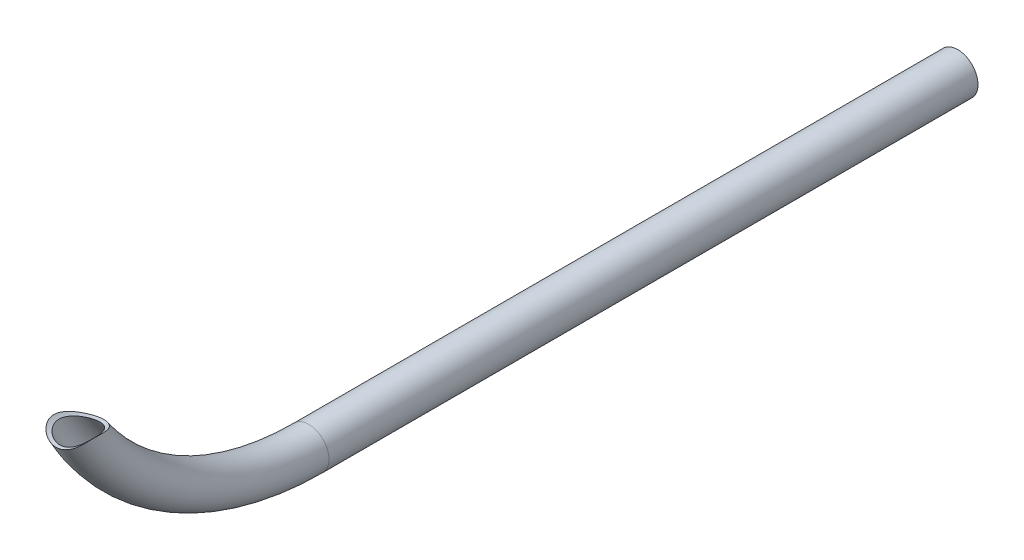
ISO-10303-21;
HEADER;
FILE_DESCRIPTION(('STEP AP214'),'2;1');
FILE_NAME('part.step','',(''),(''),'','','');
FILE_SCHEMA(('AUTOMOTIVE_DESIGN { 1 0 10303 214 1 1 1 1 }'));
ENDSEC;
DATA;
#1=APPLICATION_CONTEXT('core data for automotive mechanical design processes');
#2=APPLICATION_PROTOCOL_DEFINITION('international standard','automotive_design',2000,#1);
#3=PRODUCT_CONTEXT('',#1,'mechanical');
#4=PRODUCT('Part','Part','',(#3));
#5=PRODUCT_RELATED_PRODUCT_CATEGORY('part','',(#4));
#6=PRODUCT_DEFINITION_FORMATION('','',#4);
#7=PRODUCT_DEFINITION_CONTEXT('part definition',#1,'design');
#8=PRODUCT_DEFINITION('design','',#6,#7);
#9=PRODUCT_DEFINITION_SHAPE('','',#8);
#10=(LENGTH_UNIT() NAMED_UNIT(*) SI_UNIT(.MILLI.,.METRE.));
#11=(NAMED_UNIT(*) PLANE_ANGLE_UNIT() SI_UNIT($,.RADIAN.));
#12=(NAMED_UNIT(*) SI_UNIT($,.STERADIAN.) SOLID_ANGLE_UNIT());
#13=UNCERTAINTY_MEASURE_WITH_UNIT(LENGTH_MEASURE(1.E-05),#10,'distance_accuracy_value','');
#14=(GEOMETRIC_REPRESENTATION_CONTEXT(3) GLOBAL_UNCERTAINTY_ASSIGNED_CONTEXT((#13)) GLOBAL_UNIT_ASSIGNED_CONTEXT((#10,
#11,#12)) REPRESENTATION_CONTEXT('',''));
#15=CARTESIAN_POINT('',(0.,0.,0.));
#16=DIRECTION('',(0.,0.,1.));
#17=DIRECTION('',(1.,0.,0.));
#18=AXIS2_PLACEMENT_3D('',#15,#16,#17);
#19=CARTESIAN_POINT('',(0.,127.,304.800000000001));
#20=DIRECTION('',(-1.,0.,0.));
#21=DIRECTION('',(0.,0.,1.));
#22=AXIS2_PLACEMENT_3D('',#19,#20,#21);
#23=TOROIDAL_SURFACE('',#22,127.,9.525);
#24=CARTESIAN_POINT('',(0.,0.,304.800000000001));
#25=DIRECTION('',(0.,0.,1.));
#26=DIRECTION('',(1.,0.,0.));
#27=AXIS2_PLACEMENT_3D('',#24,#25,#26);
#28=CIRCLE('',#27,9.525);
#29=CARTESIAN_POINT('',(9.52500000000003,0.,304.800000000001));
#30=VERTEX_POINT('',#29);
#31=EDGE_CURVE('E12',#30,#30,#28,.T.);
#32=ORIENTED_EDGE('',*,*,#31,.T.);
#33=EDGE_LOOP('',(#32));
#34=FACE_BOUND('',#33,.T.);
#35=CARTESIAN_POINT('',(-3.65407289127607,60.0682852372543,402.228333893219));
#36=CARTESIAN_POINT('',(-3.39446582058791,59.9902898235014,402.043905005241));
#37=CARTESIAN_POINT('',(-3.12314992074199,59.9178171309632,401.873248482189));
#38=CARTESIAN_POINT('',(-2.55688897704432,59.7879230241038,401.568113537314));
#39=CARTESIAN_POINT('',(-2.26194025002623,59.730503961865,401.433640769002));
#40=CARTESIAN_POINT('',(-1.80286286501734,59.6588939704098,401.266174522086));
#41=CARTESIAN_POINT('',(-1.64608747824195,59.6373606851069,401.215866525132));
#42=CARTESIAN_POINT('',(-1.32829403480961,59.599892940194,401.128380667154));
#43=CARTESIAN_POINT('',(-1.16727821118621,59.5839555946979,401.09119603822));
#44=CARTESIAN_POINT('',(-0.842306863073849,59.5581658959882,401.031044427609));
#45=CARTESIAN_POINT('',(-0.678354839754438,59.5483067352475,401.008061540008));
#46=CARTESIAN_POINT('',(-0.34878644448164,59.5349698568978,400.976975266853));
#47=CARTESIAN_POINT('',(-0.183170255597932,59.5314914449251,400.968870262262));
#48=CARTESIAN_POINT('',(0.132234627307229,59.5310547334472,400.967852666404));
#49=CARTESIAN_POINT('',(0.282020053585471,59.533503886882,400.973559390485));
#50=CARTESIAN_POINT('',(0.580429881178755,59.5436424596715,400.997189237646));
#51=CARTESIAN_POINT('',(0.729054377924088,59.5513314436194,401.015111345681));
#52=CARTESIAN_POINT('',(1.02412588722164,59.5717455367284,401.062714703607));
#53=CARTESIAN_POINT('',(1.17057169103837,59.5844733406869,401.092402245746));
#54=CARTESIAN_POINT('',(1.46034040699285,59.6146479947505,401.162827465699));
#55=CARTESIAN_POINT('',(1.60366167684346,59.6320972648262,401.203570810155));
#56=CARTESIAN_POINT('',(1.92094768445456,59.6761120437016,401.306424795505));
#57=CARTESIAN_POINT('',(2.09384584439978,59.7038632188295,401.371323765817));
#58=CARTESIAN_POINT('',(2.43275197137232,59.7652394077167,401.515045262456));
#59=CARTESIAN_POINT('',(2.5987549049072,59.798868622298,401.593877747015));
#60=CARTESIAN_POINT('',(2.92350680753485,59.8712005639203,401.763709663485));
#61=CARTESIAN_POINT('',(3.0822460808694,59.9099098200009,401.854724755944));
#62=CARTESIAN_POINT('',(3.39205977312419,59.9915770960582,402.047119926029));
#63=CARTESIAN_POINT('',(3.54313590121663,60.0345341622517,402.148497677043));
#64=CARTESIAN_POINT('',(3.92298149826358,60.1498885148328,402.421362000143));
#65=CARTESIAN_POINT('',(4.14617847259037,60.2249494933534,402.599499324163));
#66=CARTESIAN_POINT('',(4.5749292539373,60.3816858171912,402.973245767583));
#67=CARTESIAN_POINT('',(4.78047219526507,60.4633651767358,403.168865498052));
#68=CARTESIAN_POINT('',(5.17559889954713,60.6317077394009,403.574457227334));
#69=CARTESIAN_POINT('',(5.36514558064082,60.7183817790632,403.784460634644));
#70=CARTESIAN_POINT('',(5.72914516537296,60.8951201496679,404.215884272408));
#71=CARTESIAN_POINT('',(5.90359257990585,60.9851856966074,404.437308608468));
#72=CARTESIAN_POINT('',(6.21801370632419,61.1563105140321,404.861918729685));
#73=CARTESIAN_POINT('',(6.35959393981204,61.2371235571711,405.06402164135));
#74=CARTESIAN_POINT('',(6.63268481873626,61.3996876183345,405.474558487916));
#75=CARTESIAN_POINT('',(6.7641948994001,61.4814386886719,405.682992776989));
#76=CARTESIAN_POINT('',(7.01780370985594,61.6452577328224,406.105612653312));
#77=CARTESIAN_POINT('',(7.13989524338635,61.7273258996139,406.319802472875));
#78=CARTESIAN_POINT('',(7.37502226881112,61.8910581533166,406.753255300646));
#79=CARTESIAN_POINT('',(7.48805728053802,61.9727222185876,406.97251857705));
#80=CARTESIAN_POINT('',(7.70546114071106,62.1349995221391,407.415822576774));
#81=CARTESIAN_POINT('',(7.80982576197272,62.21561223188,407.639865564284));
#82=CARTESIAN_POINT('',(8.01005245550382,62.3750118328613,408.092341601807));
#83=CARTESIAN_POINT('',(8.10591492004587,62.4537988082134,408.320774448688));
#84=CARTESIAN_POINT('',(8.28919635238499,62.6086927800759,408.781721672569));
#85=CARTESIAN_POINT('',(8.37662045434234,62.684801388045,409.014233464727));
#86=CARTESIAN_POINT('',(8.54306676272146,62.8334597916069,409.483365087313));
#87=CARTESIAN_POINT('',(8.62208902098279,62.9060096091562,409.719984892384));
#88=CARTESIAN_POINT('',(8.78708863321079,63.061058973088,410.24684396073));
#89=CARTESIAN_POINT('',(8.87110384885645,63.1424970880538,410.538016263692));
#90=CARTESIAN_POINT('',(9.02598645628956,63.2962918993281,411.126161344371));
#91=CARTESIAN_POINT('',(9.09685671626038,63.368650575621,411.423132841056));
#92=CARTESIAN_POINT('',(9.22424768494676,63.5013188065028,412.022282227));
#93=CARTESIAN_POINT('',(9.28079295314293,63.5616489450602,412.324450243875));
#94=CARTESIAN_POINT('',(9.37798594078855,63.6668738515069,412.934008099964));
#95=CARTESIAN_POINT('',(9.41863906569889,63.7117738670788,413.241396126491));
#96=CARTESIAN_POINT('',(9.4726256129091,63.7719067443289,413.771634638727));
#97=CARTESIAN_POINT('',(9.49044898488311,63.7919535113525,413.993479602908));
#98=CARTESIAN_POINT('',(9.51567820358175,63.8204091216456,414.438480900445));
#99=CARTESIAN_POINT('',(9.5230876317505,63.8288219659043,414.661636756449));
#100=CARTESIAN_POINT('',(9.52626243575553,63.8324202843576,415.107853017769));
#101=CARTESIAN_POINT('',(9.52204521582021,63.8276255293562,415.330913066389));
#102=CARTESIAN_POINT('',(9.50072780294525,63.8035314854817,415.77567070928));
#103=CARTESIAN_POINT('',(9.48362820925898,63.7842328712892,415.997368366442));
#104=CARTESIAN_POINT('',(9.43509153084246,63.7300505942675,416.440047974746));
#105=CARTESIAN_POINT('',(9.40348443970569,63.6949822350674,416.660989231201));
#106=CARTESIAN_POINT('',(9.32498652283707,63.6093017910756,417.097086048305));
#107=CARTESIAN_POINT('',(9.27809592549277,63.5586899385573,417.312241695358));
#108=CARTESIAN_POINT('',(9.16857348448465,63.4429856918737,417.734593476993));
#109=CARTESIAN_POINT('',(9.10593536834032,63.3778875287762,417.941786401897));
#110=CARTESIAN_POINT('',(8.96497301705563,63.2351791415148,418.346269034637));
#111=CARTESIAN_POINT('',(8.88664905937227,63.1575691386697,418.543558917566));
#112=CARTESIAN_POINT('',(8.72754541325557,63.0046448194266,418.898469315657));
#113=CARTESIAN_POINT('',(8.64885744588802,62.9307009279983,419.05763017448));
#114=CARTESIAN_POINT('',(8.48082489111687,62.7772267485083,419.367478629065));
#115=CARTESIAN_POINT('',(8.39147643689172,62.6976944377154,419.518163120897));
#116=CARTESIAN_POINT('',(8.20262218081754,62.5347277916357,419.810800081772));
#117=CARTESIAN_POINT('',(8.10311550893213,62.4512931224498,419.952751801193));
#118=CARTESIAN_POINT('',(7.89444351406386,62.2820886684786,420.227903548822));
#119=CARTESIAN_POINT('',(7.78527690679335,62.1963185742512,420.361102409223));
#120=CARTESIAN_POINT('',(7.54009124227722,62.0104765584426,420.638861555991));
#121=CARTESIAN_POINT('',(7.40253642251584,61.9102548499805,420.781967264375));
#122=CARTESIAN_POINT('',(7.11594745189997,61.7106131124383,421.056777709409));
#123=CARTESIAN_POINT('',(6.96691255829329,61.6111931356903,421.188481707205));
#124=CARTESIAN_POINT('',(6.65801850410045,61.4148600140516,421.440750543951));
#125=CARTESIAN_POINT('',(6.49815462389535,61.3179479879686,421.561310471125));
#126=CARTESIAN_POINT('',(6.16837482057322,61.1282164442304,421.791400631668));
#127=CARTESIAN_POINT('',(5.99845827492002,61.0353971806523,421.900930180816));
#128=CARTESIAN_POINT('',(5.61731612339234,60.8387192994099,422.128140260298));
#129=CARTESIAN_POINT('',(5.40422266862402,60.7359504128175,422.243642284326));
#130=CARTESIAN_POINT('',(4.96622251868712,60.5400477677898,422.459466153995));
#131=CARTESIAN_POINT('',(4.74131456921058,60.4469150355246,422.559786383425));
#132=CARTESIAN_POINT('',(4.28099319486151,60.2719971435257,422.745248897871));
#133=CARTESIAN_POINT('',(4.04557739880043,60.1902145623386,422.830387735198));
#134=CARTESIAN_POINT('',(3.56576676957602,60.0395092873635,422.985370728169));
#135=CARTESIAN_POINT('',(3.32137210048271,59.9705863587321,423.055215163123));
#136=CARTESIAN_POINT('',(2.81902477765969,59.8452999558493,423.181029266192));
#137=CARTESIAN_POINT('',(2.56088612483817,59.7892911724653,423.236610986578));
#138=CARTESIAN_POINT('',(2.03870581233758,59.6931416936871,423.331428088934));
#139=CARTESIAN_POINT('',(1.77466399030895,59.6530014352792,423.370663020748));
#140=CARTESIAN_POINT('',(1.2427174011836,59.5893595971334,423.432648535548));
#141=CARTESIAN_POINT('',(0.97481339551633,59.5658547822807,423.455402323661));
#142=CARTESIAN_POINT('',(0.437167863702882,59.5359214716572,423.48435178717));
#143=CARTESIAN_POINT('',(0.167426407103095,59.5294923331435,423.490548085804));
#144=CARTESIAN_POINT('',(-0.36146588442569,59.5337467678595,423.486440885314));
#145=CARTESIAN_POINT('',(-0.620627187403028,59.5437852280946,423.476759397387));
#146=CARTESIAN_POINT('',(-1.13682518773813,59.5795876924395,423.442096740522));
#147=CARTESIAN_POINT('',(-1.39386194048517,59.6053512852593,423.417115971736));
#148=CARTESIAN_POINT('',(-1.90396139542837,59.6721460098193,423.351943136385));
#149=CARTESIAN_POINT('',(-2.15702448639812,59.7131756381442,423.311752567691));
#150=CARTESIAN_POINT('',(-2.65746000353367,59.8097826841055,423.21627972999));
#151=CARTESIAN_POINT('',(-2.90483236871844,59.8653602575567,423.160997299342));
#152=CARTESIAN_POINT('',(-3.39203146376182,59.9900369889648,423.03552936901));
#153=CARTESIAN_POINT('',(-3.63186457327754,60.0591243368839,422.965356881456));
#154=CARTESIAN_POINT('',(-4.10269555703875,60.2096454920464,422.810200190935));
#155=CARTESIAN_POINT('',(-4.3336934281312,60.2910793036959,422.725215982681));
#156=CARTESIAN_POINT('',(-4.78560133967106,60.4649139320031,422.540455163501));
#157=CARTESIAN_POINT('',(-5.00650506015247,60.5573214925109,422.440669446919));
#158=CARTESIAN_POINT('',(-5.43678915326098,60.7513968299268,422.226348496822));
#159=CARTESIAN_POINT('',(-5.6461693141017,60.8530647769363,422.111812992356));
#160=CARTESIAN_POINT('',(-6.06035731435301,61.0679774720857,421.863004013094));
#161=CARTESIAN_POINT('',(-6.26464476785758,61.181523022984,421.728123046904));
#162=CARTESIAN_POINT('',(-6.6581868986955,61.4140974163791,421.442060106849));
#163=CARTESIAN_POINT('',(-6.84743984437133,61.5331268880202,421.29087625995));
#164=CARTESIAN_POINT('',(-7.20950762935861,61.7737065486939,420.971974147088));
#165=CARTESIAN_POINT('',(-7.38233166453008,61.8952552806385,420.80426523915));
#166=CARTESIAN_POINT('',(-7.7103183755973,62.1375625195798,420.451887839535));
#167=CARTESIAN_POINT('',(-7.86548628912784,62.2583212508563,420.26722440689));
#168=CARTESIAN_POINT('',(-8.12282673326841,62.4675189893796,419.925799115829));
#169=CARTESIAN_POINT('',(-8.22891888710564,62.5569271801467,419.772574587989));
#170=CARTESIAN_POINT('',(-8.42930440741372,62.7310168489821,419.456073514601));
#171=CARTESIAN_POINT('',(-8.5236006176663,62.8156994635611,419.292799406036));
#172=CARTESIAN_POINT('',(-8.69967527157459,62.9781431759824,418.956745801445));
#173=CARTESIAN_POINT('',(-8.78147457954073,63.0559157176882,418.783982818213));
#174=CARTESIAN_POINT('',(-8.93226090460856,63.2026403358156,418.429332616981));
#175=CARTESIAN_POINT('',(-9.00124799898925,63.2715924654381,418.247445454024));
#176=CARTESIAN_POINT('',(-9.1264652303261,63.3991674988767,417.874557954176));
#177=CARTESIAN_POINT('',(-9.18262203067246,63.4577306147717,417.683512426583));
#178=CARTESIAN_POINT('',(-9.28167612057952,63.5625879324055,417.294742141975));
#179=CARTESIAN_POINT('',(-9.32457396775987,63.6088826500935,417.097017666239));
#180=CARTESIAN_POINT('',(-9.39747556660737,63.6883949149186,416.696533092845));
#181=CARTESIAN_POINT('',(-9.4274729859219,63.7216060391238,416.493770573728));
#182=CARTESIAN_POINT('',(-9.47522062796903,63.774805013772,416.085104358627));
#183=CARTESIAN_POINT('',(-9.49296921740743,63.7947911007357,415.879200247474));
#184=CARTESIAN_POINT('',(-9.5198121875461,63.8250792871104,415.419889326343));
#185=CARTESIAN_POINT('',(-9.52610039081252,63.8322350745863,415.166111906411));
#186=CARTESIAN_POINT('',(-9.52358482214345,63.8293871723276,414.658757640843));
#187=CARTESIAN_POINT('',(-9.51477643267342,63.8193782324857,414.405180880316));
#188=CARTESIAN_POINT('',(-9.48384322647918,63.7845200762154,413.899407557627));
#189=CARTESIAN_POINT('',(-9.46169094568249,63.7596402537178,413.647214927469));
#190=CARTESIAN_POINT('',(-9.40560545984943,63.6974157256808,413.145638123203));
#191=CARTESIAN_POINT('',(-9.37166713856744,63.660065607137,412.896255217397));
#192=CARTESIAN_POINT('',(-9.29734640983724,63.5795435018926,412.426720064066));
#193=CARTESIAN_POINT('',(-9.25800137390714,63.5373810787466,412.206225337492));
#194=CARTESIAN_POINT('',(-9.17156282038169,63.446241279529,411.768244224788));
#195=CARTESIAN_POINT('',(-9.12447075344481,63.3972651796066,411.550757283687));
#196=CARTESIAN_POINT('',(-9.02301177319968,63.2936598213687,411.118662170746));
#197=CARTESIAN_POINT('',(-8.9686389021417,63.2390259417815,410.904056516543));
#198=CARTESIAN_POINT('',(-8.85300976589887,63.1251636741635,410.47793084496));
#199=CARTESIAN_POINT('',(-8.79175270011614,63.0659347520004,410.266411189705));
#200=CARTESIAN_POINT('',(-8.59741864530453,62.8821186420055,409.634468776134));
#201=CARTESIAN_POINT('',(-8.45427079730204,62.7519169995944,409.218736461485));
#202=CARTESIAN_POINT('',(-8.1420822730203,62.4824508818424,408.400397568936));
#203=CARTESIAN_POINT('',(-7.97305234311982,62.3431901816107,407.997785627148));
#204=CARTESIAN_POINT('',(-7.6899322391332,62.1232711233112,407.383398739019));
#205=CARTESIAN_POINT('',(-7.58505317795123,62.0442399642502,407.16675720242));
#206=CARTESIAN_POINT('',(-7.36689057679543,61.8853747549063,406.738025379057));
#207=CARTESIAN_POINT('',(-7.25360684364731,61.8055406862056,406.525935197047));
#208=CARTESIAN_POINT('',(-7.01817903622669,61.6456259952263,406.106530334896));
#209=CARTESIAN_POINT('',(-6.89602678826792,61.5655452123446,405.89922029827));
#210=CARTESIAN_POINT('',(-6.6424989909186,61.4058329060845,405.490144724774));
#211=CARTESIAN_POINT('',(-6.5111239922481,61.3262013561872,405.288378857843));
#212=CARTESIAN_POINT('',(-6.23976556523533,61.1687130388342,404.892846455157));
#213=CARTESIAN_POINT('',(-6.09986708389426,61.0908468541662,404.699025551629));
#214=CARTESIAN_POINT('',(-5.80977184589791,60.9368475847093,404.318461890857));
#215=CARTESIAN_POINT('',(-5.65957382006612,60.860714715056,404.131720010355));
#216=CARTESIAN_POINT('',(-5.34845105032629,60.7111018406494,403.7669275379));
#217=CARTESIAN_POINT('',(-5.18754752283192,60.637617008975,403.588860899524));
#218=CARTESIAN_POINT('',(-4.85400397706453,60.4940612420678,403.242693687061));
#219=CARTESIAN_POINT('',(-4.68136886677605,60.423988900004,403.074588999761));
#220=CARTESIAN_POINT('',(-4.36840076234326,60.3053279995282,402.791044195854));
#221=CARTESIAN_POINT('',(-4.23082794158079,60.2557595792302,402.672971263197));
#222=CARTESIAN_POINT('',(-3.94815187924166,60.1596140001923,402.444525835049));
#223=CARTESIAN_POINT('',(-3.80304005002391,60.1130403941587,402.334162472387));
#224=CARTESIAN_POINT('',(-3.65407289127607,60.0682852372543,402.228333893219));
#225=B_SPLINE_CURVE_WITH_KNOTS('',3,(#35,#36,#37,#38,#39,#40,#41,#42,#43,#44,#45,#46,#47,#48,
#49,#50,#51,#52,#53,#54,#55,#56,#57,#58,#59,#60,#61,#62,#63,#64,#65,#66,#67,#68,#69,#70,#71,#72,
#73,#74,#75,#76,#77,#78,#79,#80,#81,#82,#83,#84,#85,#86,#87,#88,#89,#90,#91,#92,#93,#94,#95,#96,
#97,#98,#99,#100,#101,#102,#103,#104,#105,#106,#107,#108,#109,#110,#111,#112,#113,#114,#115,
#116,#117,#118,#119,#120,#121,#122,#123,#124,#125,#126,#127,#128,#129,#130,#131,#132,#133,#134,
#135,#136,#137,#138,#139,#140,#141,#142,#143,#144,#145,#146,#147,#148,#149,#150,#151,#152,#153,
#154,#155,#156,#157,#158,#159,#160,#161,#162,#163,#164,#165,#166,#167,#168,#169,#170,#171,#172,
#173,#174,#175,#176,#177,#178,#179,#180,#181,#182,#183,#184,#185,#186,#187,#188,#189,#190,#191,
#192,#193,#194,#195,#196,#197,#198,#199,#200,#201,#202,#203,#204,#205,#206,#207,#208,#209,#210,
#211,#212,#213,#214,#215,#216,#217,#218,#219,#220,#221,#222,#223,#224),.UNSPECIFIED.,.T.,.F.,(4,
2,2,2,2,2,2,2,2,2,2,2,2,2,2,2,2,2,2,2,2,2,2,2,2,2,2,2,2,2,2,2,2,2,2,2,2,2,2,2,2,2,2,2,2,2,2,2,2,
2,2,2,2,2,2,2,2,2,2,2,2,2,2,2,2,2,2,2,2,2,2,2,2,2,2,2,2,2,2,2,2,2,2,2,2,2,2,2,2,2,2,2,2,2,4),
(0.,0.983233381704172,1.96662029909892,2.46421237835984,2.96154746585824,3.45832452456597,
3.95504751996865,4.4041976985057,4.85331055919571,5.30266393387208,5.75224806071677,
6.31165425040188,6.87146187436785,7.43199615995152,7.9924048703755,8.87677101574265,
9.76167762694976,10.6485822557333,11.5358079625781,12.3144879329674,13.0932115427583,
13.8725243633076,14.6518784749152,15.4316103518376,16.2113062347478,16.9905246960908,
17.7697383493613,18.7107268187399,19.6515097255634,20.5906686221144,21.529507800118,
22.1994266963598,22.8691151453576,23.5378016650337,24.2064570811323,24.8831564726792,
25.5598457525,26.236804996365,26.9137522669805,27.4901774597792,28.0668123755084,
28.6434967206706,29.2202578514977,29.8867148910421,30.5532150861351,31.2200076559115,
31.8868415617778,32.6757499265959,33.4647422172931,34.2539134602089,35.0430702898449,
35.8518389980132,36.6606299764496,37.46926362508,38.2778668356249,39.0555430165697,
39.8331988583115,40.6107781359473,41.388365742135,42.1652766077105,42.9421877505408,
43.7195788344494,44.4969842009152,45.3055762715994,46.1142613403755,46.9224910599733,
47.7304803921548,48.3500248747409,48.9694197076898,49.5877688497033,50.2061142619199,
50.8279102599327,51.4496801040813,52.0717548051178,52.6939124393656,53.4545734288668,
54.2154671202315,54.9779322410547,55.7407287577427,56.4241882413673,57.107519890202,
57.7914141534028,58.475388032596,59.8498978345152,61.2238384724408,61.9836921883121,
62.7435633741942,63.5041440119181,64.2646792714988,65.018590203871,65.7725942055538,
66.5251460222954,67.2773849195523,67.8409251025725,68.4051219207494),.UNSPECIFIED.);
#226=CARTESIAN_POINT('',(-3.65407289127607,60.0682852372543,402.228333893219));
#227=VERTEX_POINT('',#226);
#228=EDGE_CURVE('E57',#227,#227,#225,.T.);
#229=ORIENTED_EDGE('',*,*,#228,.T.);
#230=EDGE_LOOP('',(#229));
#231=FACE_BOUND('',#230,.T.);
#232=ADVANCED_FACE('F34',(#34,#231),#23,.T.);
#233=CARTESIAN_POINT('',(0.,127.,304.800000000001));
#234=DIRECTION('',(-1.,0.,0.));
#235=DIRECTION('',(0.,0.,1.));
#236=AXIS2_PLACEMENT_3D('',#233,#234,#235);
#237=TOROIDAL_SURFACE('',#236,127.,7.9375);
#238=CARTESIAN_POINT('',(0.,0.,304.800000000001));
#239=DIRECTION('',(0.,0.,1.));
#240=DIRECTION('',(1.,0.,0.));
#241=AXIS2_PLACEMENT_3D('',#238,#239,#240);
#242=CIRCLE('',#241,7.9375);
#243=CARTESIAN_POINT('',(7.93750000000002,0.,304.800000000001));
#244=VERTEX_POINT('',#243);
#245=EDGE_CURVE('E45',#244,#244,#242,.T.);
#246=ORIENTED_EDGE('',*,*,#245,.F.);
#247=EDGE_LOOP('',(#246));
#248=FACE_BOUND('',#247,.T.);
#249=CARTESIAN_POINT('',(-2.27028495920626,59.7358185867193,403.443200731703));
#250=CARTESIAN_POINT('',(-2.02505468389567,59.6912736256843,403.324248763858));
#251=CARTESIAN_POINT('',(-1.7706599269475,59.652540446446,403.221451036993));
#252=CARTESIAN_POINT('',(-1.37844966904584,59.6055895291678,403.097185430494));
#253=CARTESIAN_POINT('',(-1.24592472286831,59.5917962622499,403.0607491773));
#254=CARTESIAN_POINT('',(-0.97804797480442,59.568254341023,402.99862736653));
#255=CARTESIAN_POINT('',(-0.842697467827245,59.5585038749231,402.972936993115));
#256=CARTESIAN_POINT('',(-0.569192850236967,59.5432672992741,402.932815109552));
#257=CARTESIAN_POINT('',(-0.431026236595013,59.5378093122803,402.918457847052));
#258=CARTESIAN_POINT('',(-0.153859069822565,59.5314256519202,402.90166724946));
#259=CARTESIAN_POINT('',(-0.0148585155632302,59.5304999846905,402.899233930512));
#260=CARTESIAN_POINT('',(0.262792758825097,59.5332101108435,402.906360848623));
#261=CARTESIAN_POINT('',(0.401443464209659,59.5368460933633,402.915921582986));
#262=CARTESIAN_POINT('',(0.677233444343033,59.5485686499136,402.946772289181));
#263=CARTESIAN_POINT('',(0.814372744997637,59.5566551475399,402.968062059657));
#264=CARTESIAN_POINT('',(1.07557017012261,59.5762529395823,403.019726944881));
#265=CARTESIAN_POINT('',(1.1998182137593,59.5874501402894,403.049269802585));
#266=CARTESIAN_POINT('',(1.44552116576652,59.6131778075776,403.117259527925));
#267=CARTESIAN_POINT('',(1.56697516557626,59.6277093420129,403.155709248112));
#268=CARTESIAN_POINT('',(1.92628088704102,59.6758623801694,403.283372730893));
#269=CARTESIAN_POINT('',(2.15918518178442,59.7140508960473,403.384923293027));
#270=CARTESIAN_POINT('',(2.73694445026097,59.8244652901018,403.680279148402));
#271=CARTESIAN_POINT('',(3.07037609169459,59.9037117513168,403.89374199212));
#272=CARTESIAN_POINT('',(3.54056617387434,60.0336678742867,404.248663930172));
#273=CARTESIAN_POINT('',(3.69255564487325,60.0789280400618,404.373020653497));
#274=CARTESIAN_POINT('',(3.98696385423979,60.1723146550277,404.63160972825));
#275=CARTESIAN_POINT('',(4.12938451128834,60.220440525932,404.765840088501));
#276=CARTESIAN_POINT('',(4.49137283480014,60.3495708810613,405.12927860955));
#277=CARTESIAN_POINT('',(4.70343299656025,60.4323006294794,405.365348227107));
#278=CARTESIAN_POINT('',(5.10542716336106,60.6005971034788,405.854749453019));
#279=CARTESIAN_POINT('',(5.29534644589722,60.6861656686988,406.108092371782));
#280=CARTESIAN_POINT('',(5.65501352112826,60.8580094216882,406.629195769077));
#281=CARTESIAN_POINT('',(5.82472160384627,60.9442856557922,406.896983175832));
#282=CARTESIAN_POINT('',(6.14477835581486,61.1152888489154,407.444222446604));
#283=CARTESIAN_POINT('',(6.29513128453613,61.2000161452746,407.723671726216));
#284=CARTESIAN_POINT('',(6.58707494517023,61.3716435500844,408.312485910542));
#285=CARTESIAN_POINT('',(6.7273393188244,61.4582882795037,408.622582786162));
#286=CARTESIAN_POINT('',(6.98697432559636,61.6248384532008,409.253258682637));
#287=CARTESIAN_POINT('',(7.10634006366635,61.7047423163133,409.573840138463));
#288=CARTESIAN_POINT('',(7.32340916142597,61.8545919572473,410.22388870395));
#289=CARTESIAN_POINT('',(7.42115081854136,61.9245552603994,410.553338926358));
#290=CARTESIAN_POINT('',(7.59377523970769,62.0510710018559,411.220659104821));
#291=CARTESIAN_POINT('',(7.66866877822161,62.1076297585116,411.558525010741));
#292=CARTESIAN_POINT('',(7.77195209038381,62.1868770349854,412.125318445438));
#293=CARTESIAN_POINT('',(7.80749653395209,62.2145443678594,412.352257400234));
#294=CARTESIAN_POINT('',(7.86650920777313,62.2608211701451,412.808594797445));
#295=CARTESIAN_POINT('',(7.88998098975973,62.2794333034768,413.03799249621));
#296=CARTESIAN_POINT('',(7.92361983913015,62.306194988877,413.498112408828));
#297=CARTESIAN_POINT('',(7.93380369881169,62.3143577458505,413.728832580168));
#298=CARTESIAN_POINT('',(7.93952732338728,62.3189374729593,414.190594737889));
#299=CARTESIAN_POINT('',(7.93506965876761,62.3153565048392,414.421636660663));
#300=CARTESIAN_POINT('',(7.91201845626962,62.2969593579553,414.846296280549));
#301=CARTESIAN_POINT('',(7.89574328311415,62.2839867471246,415.040119038012));
#302=CARTESIAN_POINT('',(7.85091860342587,62.2485699656028,415.425478611266));
#303=CARTESIAN_POINT('',(7.82237029522154,62.2261267196127,415.617015648354));
#304=CARTESIAN_POINT('',(7.75233549232586,62.1717641480129,415.996250942683));
#305=CARTESIAN_POINT('',(7.71085608551809,62.1398500141116,416.183951243028));
#306=CARTESIAN_POINT('',(7.61449467799455,62.0669440244963,416.554088638907));
#307=CARTESIAN_POINT('',(7.55961257735151,62.0259521011007,416.736525695188));
#308=CARTESIAN_POINT('',(7.43612217135096,61.9356225700897,417.095063062049));
#309=CARTESIAN_POINT('',(7.36748235726492,61.8862658457424,417.271147711113));
#310=CARTESIAN_POINT('',(7.21666451307036,61.7804975701289,417.615211995966));
#311=CARTESIAN_POINT('',(7.13448620244855,61.7240858726919,417.783191463725));
#312=CARTESIAN_POINT('',(6.95689973127582,61.6056707545368,418.110082125405));
#313=CARTESIAN_POINT('',(6.86148262419484,61.5436635624793,418.268987083567));
#314=CARTESIAN_POINT('',(6.65802404329967,61.4157450441883,418.576816894186));
#315=CARTESIAN_POINT('',(6.549982445712,61.3498336796805,418.725741648772));
#316=CARTESIAN_POINT('',(6.32497330339204,61.2175635180968,419.009294165418));
#317=CARTESIAN_POINT('',(6.20831526009449,61.1512620834806,419.144194936462));
#318=CARTESIAN_POINT('',(5.96435221661345,61.0180513676218,419.403776756769));
#319=CARTESIAN_POINT('',(5.83704291892874,60.9511418508338,419.528453640396));
#320=CARTESIAN_POINT('',(5.57255573074135,60.8181640449151,419.76735982536));
#321=CARTESIAN_POINT('',(5.43537711904566,60.7520958176769,419.881588361804));
#322=CARTESIAN_POINT('',(5.15197388255462,60.6221387912441,420.099459582403));
#323=CARTESIAN_POINT('',(5.00575200947327,60.5582493381754,420.203105461485));
#324=CARTESIAN_POINT('',(4.68830382009936,60.4269082867739,420.410724337693));
#325=CARTESIAN_POINT('',(4.5161032259192,60.3598479243679,420.513457794197));
#326=CARTESIAN_POINT('',(4.16253640184522,60.2313049370188,420.705812564297));
#327=CARTESIAN_POINT('',(3.9811696254106,60.1698226452849,420.795433094781));
#328=CARTESIAN_POINT('',(3.61035051341834,60.0536835228134,420.961545581844));
#329=CARTESIAN_POINT('',(3.42089599430298,59.9990285511782,421.038033964609));
#330=CARTESIAN_POINT('',(3.0351221714699,59.8976449932882,421.177808277586));
#331=CARTESIAN_POINT('',(2.83880282989895,59.8509164507489,421.241094134986));
#332=CARTESIAN_POINT('',(2.42944678437108,59.7639343089497,421.357562875905));
#333=CARTESIAN_POINT('',(2.21608715067244,59.7241843976892,421.40998953084));
#334=CARTESIAN_POINT('',(1.78456434908632,59.6553574917168,421.500016491371));
#335=CARTESIAN_POINT('',(1.56640098660891,59.6262809302081,421.537616195186));
#336=CARTESIAN_POINT('',(1.12682999891087,59.5794079714177,421.597932751553));
#337=CARTESIAN_POINT('',(0.905422419382866,59.5616114154206,421.620649813513));
#338=CARTESIAN_POINT('',(0.460957910649418,59.5376670858477,421.651163880506));
#339=CARTESIAN_POINT('',(0.237901007939137,59.5315191255522,421.658961124694));
#340=CARTESIAN_POINT('',(-0.206969574655654,59.5309996762683,421.659620840309));
#341=CARTESIAN_POINT('',(-0.428783056712944,59.53656092878,421.652568608104));
#342=CARTESIAN_POINT('',(-0.870856071094484,59.5592101110747,421.62371420175));
#343=CARTESIAN_POINT('',(-1.09111560420113,59.5762980350537,421.601912035028));
#344=CARTESIAN_POINT('',(-1.52850945631257,59.621650424437,421.543593826357));
#345=CARTESIAN_POINT('',(-1.74564381449132,59.6499147496189,421.50707796901));
#346=CARTESIAN_POINT('',(-2.17526339142286,59.7170381018805,421.419384877735));
#347=CARTESIAN_POINT('',(-2.38774859627055,59.7558971606434,421.368207599962));
#348=CARTESIAN_POINT('',(-2.80642520765286,59.8433657507568,421.251299601989));
#349=CARTESIAN_POINT('',(-3.01262159389832,59.8919673238457,421.185580755682));
#350=CARTESIAN_POINT('',(-3.41749234227974,59.99791306066,421.0396235825));
#351=CARTESIAN_POINT('',(-3.61616668411017,60.0552572479838,420.959385216433));
#352=CARTESIAN_POINT('',(-4.00471811297789,60.1774653092477,420.784404268049));
#353=CARTESIAN_POINT('',(-4.19459176371567,60.2423320863938,420.689656081379));
#354=CARTESIAN_POINT('',(-4.56416042985218,60.3780987917433,420.485718822916));
#355=CARTESIAN_POINT('',(-4.74385536762849,60.4489987659452,420.376529641016));
#356=CARTESIAN_POINT('',(-5.09323871838218,60.5957391220296,420.142798170523));
#357=CARTESIAN_POINT('',(-5.26283254937055,60.6716153778034,420.018136861934));
#358=CARTESIAN_POINT('',(-5.58913082154305,60.8258048052994,419.754268791672));
#359=CARTESIAN_POINT('',(-5.74583500158621,60.9041180263497,419.615061735437));
#360=CARTESIAN_POINT('',(-6.0450241163687,61.0609234223849,419.322389129855));
#361=CARTESIAN_POINT('',(-6.18751766784163,61.139415459042,419.168932331329));
#362=CARTESIAN_POINT('',(-6.45720124117567,61.2942152165176,418.848090370609));
#363=CARTESIAN_POINT('',(-6.58439263500879,61.3705231326933,418.680706459382));
#364=CARTESIAN_POINT('',(-6.81549663566616,61.5141402826458,418.342821258864));
#365=CARTESIAN_POINT('',(-6.92033157124044,61.5817147407043,418.173063938805));
#366=CARTESIAN_POINT('',(-7.1147393382698,61.7105990397168,417.822766074364));
#367=CARTESIAN_POINT('',(-7.20431313784088,61.7719092779533,417.642226214972));
#368=CARTESIAN_POINT('',(-7.3676451496994,61.8863115553146,417.271855173945));
#369=CARTESIAN_POINT('',(-7.44141833460573,61.9394113612328,417.082032999649));
#370=CARTESIAN_POINT('',(-7.57312136907615,62.0359317464315,416.694602499295));
#371=CARTESIAN_POINT('',(-7.63105221235253,62.0793529327728,416.496994662484));
#372=CARTESIAN_POINT('',(-7.7260661537447,62.1515143883376,416.116968482065));
#373=CARTESIAN_POINT('',(-7.76470002267382,62.1813177204366,415.935135217807));
#374=CARTESIAN_POINT('',(-7.82993752905373,62.2320606121676,415.568136095558));
#375=CARTESIAN_POINT('',(-7.85654234333557,62.2530010388659,415.382970565413));
#376=CARTESIAN_POINT('',(-7.89835944138871,62.2860687907532,415.01053131718));
#377=CARTESIAN_POINT('',(-7.91356770158158,62.2981930033137,414.8232568782));
#378=CARTESIAN_POINT('',(-7.93332469462621,62.3139669143594,414.447775339723));
#379=CARTESIAN_POINT('',(-7.93787056898776,62.3176143402917,414.259568003672));
#380=CARTESIAN_POINT('',(-7.93688896005607,62.3168235180927,413.790889097542));
#381=CARTESIAN_POINT('',(-7.92532956651523,62.3075439306373,413.510425204542));
#382=CARTESIAN_POINT('',(-7.88276213966272,62.2737026742971,412.951906930751));
#383=CARTESIAN_POINT('',(-7.85174466469185,62.2491335865231,412.673853786173));
#384=CARTESIAN_POINT('',(-7.77225395333076,62.187116960624,412.120802467081));
#385=CARTESIAN_POINT('',(-7.72372269654948,62.1496266352592,411.845817616296));
#386=CARTESIAN_POINT('',(-7.61088415985848,62.0641738368681,411.300840130984));
#387=CARTESIAN_POINT('',(-7.54657756107912,62.016211815987,411.03084728146));
#388=CARTESIAN_POINT('',(-7.36951224680495,61.8872992684938,410.37003333698));
#389=CARTESIAN_POINT('',(-7.24822004832363,61.8014727895515,409.982434354145));
#390=CARTESIAN_POINT('',(-6.97602002624988,61.6174772641858,409.220638656946));
#391=CARTESIAN_POINT('',(-6.82509364807337,61.5193004988976,408.846450513865));
#392=CARTESIAN_POINT('',(-6.49406874276667,61.3154415687474,408.113555555502));
#393=CARTESIAN_POINT('',(-6.31398399708922,61.209762962753,407.754841527453));
#394=CARTESIAN_POINT('',(-5.92358184835043,60.9951095339568,407.055486660886));
#395=CARTESIAN_POINT('',(-5.71328675887099,60.8861371904319,406.714832735068));
#396=CARTESIAN_POINT('',(-5.35089265308861,60.7125452709144,406.187895896563));
#397=CARTESIAN_POINT('',(-5.20925506597825,60.6476562370722,405.994468761761));
#398=CARTESIAN_POINT('',(-4.91351722402296,60.5191471396587,405.616977070203));
#399=CARTESIAN_POINT('',(-4.75942064905608,60.4555267082646,405.432909774906));
#400=CARTESIAN_POINT('',(-4.43841070907712,60.3308270975431,405.076450697322));
#401=CARTESIAN_POINT('',(-4.27153929470505,60.2697405369818,404.904023926416));
#402=CARTESIAN_POINT('',(-3.92378647790424,60.1511988753616,404.572686372559));
#403=CARTESIAN_POINT('',(-3.74291298844357,60.0937417560667,404.41376806061));
#404=CARTESIAN_POINT('',(-3.3570965733751,59.981262408726,404.105101371432));
#405=CARTESIAN_POINT('',(-3.15140994730345,59.9264956478651,403.956178370078));
#406=CARTESIAN_POINT('',(-2.72328126224946,59.8247113218281,403.681138968556));
#407=CARTESIAN_POINT('',(-2.50083309143749,59.7776966034279,403.555030945068));
#408=CARTESIAN_POINT('',(-2.27028495920626,59.7358185867193,403.443200731703));
#409=B_SPLINE_CURVE_WITH_KNOTS('',3,(#249,#250,#251,#252,#253,#254,#255,#256,#257,#258,#259,
#260,#261,#262,#263,#264,#265,#266,#267,#268,#269,#270,#271,#272,#273,#274,#275,#276,#277,#278,
#279,#280,#281,#282,#283,#284,#285,#286,#287,#288,#289,#290,#291,#292,#293,#294,#295,#296,#297,
#298,#299,#300,#301,#302,#303,#304,#305,#306,#307,#308,#309,#310,#311,#312,#313,#314,#315,#316,
#317,#318,#319,#320,#321,#322,#323,#324,#325,#326,#327,#328,#329,#330,#331,#332,#333,#334,#335,
#336,#337,#338,#339,#340,#341,#342,#343,#344,#345,#346,#347,#348,#349,#350,#351,#352,#353,#354,
#355,#356,#357,#358,#359,#360,#361,#362,#363,#364,#365,#366,#367,#368,#369,#370,#371,#372,#373,
#374,#375,#376,#377,#378,#379,#380,#381,#382,#383,#384,#385,#386,#387,#388,#389,#390,#391,#392,
#393,#394,#395,#396,#397,#398,#399,#400,#401,#402,#403,#404,#405,#406,#407,#408),.UNSPECIFIED.,
.T.,.F.,(4,2,2,2,2,2,2,2,2,2,2,2,2,2,2,2,2,2,2,2,2,2,2,2,2,2,2,2,2,2,2,2,2,2,2,2,2,2,2,2,2,2,2,
2,2,2,2,2,2,2,2,2,2,2,2,2,2,2,2,2,2,2,2,2,2,2,2,2,2,2,2,2,2,2,2,2,2,2,2,4),(0.,
0.827729204444842,1.24170498530356,1.65549504087026,2.07197400435223,2.4884535317178,
2.90495032790911,3.3214399741212,3.70564255386661,4.08996835053688,4.85828899147061,
6.06236454531776,6.66663411172438,7.27078214978441,8.25306889487081,9.2360051270808,
10.220841791399,11.2054613517679,12.2582175243753,13.311219953133,14.3623422565481,
15.412968114403,16.1066394394118,16.8001065719034,17.4926965002062,18.1851648429618,
18.7693991187998,19.3535763639256,19.937433967092,20.5212959234937,21.1065106770475,
21.6917375575882,22.2773618673852,22.8629919192631,23.4332191899505,24.003677652256,
24.5741778428261,25.1445052857131,25.7781096453121,26.4117518287424,27.0455661806846,
27.6793840280872,28.3484001255825,29.0174433736882,29.6864772078068,30.355500317637,
31.0206910009523,31.6858813493278,32.3510633522904,33.016247344467,33.6808901731377,
34.3455347958639,35.0104367850591,35.6753438440856,36.3457260129913,37.0161217603214,
37.6861085039473,38.3560351325755,38.9871035841399,39.6181319878911,40.2485597590481,
40.8789479774919,41.4431131034783,42.0072230238985,42.5715320108542,43.1359922667148,
43.9772128887714,44.8188420129942,45.6632853094606,46.5076921518986,47.7513065937207,
48.9957021861104,50.2395113332906,51.4824064727412,52.2270988246083,52.971572022577,
53.7136974989608,54.4554065986872,55.2332939289373,56.0114662889215),.UNSPECIFIED.);
#410=CARTESIAN_POINT('',(-2.27028495920626,59.7358185867193,403.443200731703));
#411=VERTEX_POINT('',#410);
#412=EDGE_CURVE('E38',#411,#411,#409,.T.);
#413=ORIENTED_EDGE('',*,*,#412,.F.);
#414=EDGE_LOOP('',(#413));
#415=FACE_BOUND('',#414,.T.);
#416=ADVANCED_FACE('F77',(#248,#415),#237,.F.);
#417=CARTESIAN_POINT('',(0.,0.,304.800000000001));
#418=DIRECTION('',(0.,0.,-1.));
#419=DIRECTION('',(0.,1.,0.));
#420=AXIS2_PLACEMENT_3D('',#417,#418,#419);
#421=CYLINDRICAL_SURFACE('',#420,7.9375);
#422=ORIENTED_EDGE('',*,*,#245,.T.);
#423=EDGE_LOOP('',(#422));
#424=FACE_BOUND('',#423,.T.);
#425=CARTESIAN_POINT('',(0.,0.,0.));
#426=DIRECTION('',(0.,0.,1.));
#427=DIRECTION('',(1.,0.,0.));
#428=AXIS2_PLACEMENT_3D('',#425,#426,#427);
#429=CIRCLE('',#428,7.9375);
#430=CARTESIAN_POINT('',(7.93750000000002,0.,0.));
#431=VERTEX_POINT('',#430);
#432=EDGE_CURVE('E54',#431,#431,#429,.T.);
#433=ORIENTED_EDGE('',*,*,#432,.F.);
#434=EDGE_LOOP('',(#433));
#435=FACE_BOUND('',#434,.T.);
#436=ADVANCED_FACE('F74',(#424,#435),#421,.F.);
#437=CARTESIAN_POINT('',(0.,0.,304.800000000001));
#438=DIRECTION('',(0.,0.,-1.));
#439=DIRECTION('',(0.,1.,0.));
#440=AXIS2_PLACEMENT_3D('',#437,#438,#439);
#441=CYLINDRICAL_SURFACE('',#440,9.525);
#442=ORIENTED_EDGE('',*,*,#31,.F.);
#443=EDGE_LOOP('',(#442));
#444=FACE_BOUND('',#443,.T.);
#445=CARTESIAN_POINT('',(0.,0.,0.));
#446=DIRECTION('',(0.,0.,1.));
#447=DIRECTION('',(1.,0.,0.));
#448=AXIS2_PLACEMENT_3D('',#445,#446,#447);
#449=CIRCLE('',#448,9.525);
#450=CARTESIAN_POINT('',(9.52500000000003,0.,0.));
#451=VERTEX_POINT('',#450);
#452=EDGE_CURVE('E49',#451,#451,#449,.T.);
#453=ORIENTED_EDGE('',*,*,#452,.T.);
#454=EDGE_LOOP('',(#453));
#455=FACE_BOUND('',#454,.T.);
#456=ADVANCED_FACE('F70',(#444,#455),#441,.T.);
#457=CARTESIAN_POINT('',(0.,0.,0.));
#458=DIRECTION('',(0.,0.,1.));
#459=DIRECTION('',(1.,0.,0.));
#460=AXIS2_PLACEMENT_3D('',#457,#458,#459);
#461=PLANE('',#460);
#462=ORIENTED_EDGE('',*,*,#432,.T.);
#463=EDGE_LOOP('',(#462));
#464=FACE_BOUND('',#463,.T.);
#465=ORIENTED_EDGE('',*,*,#452,.F.);
#466=EDGE_LOOP('',(#465));
#467=FACE_BOUND('',#466,.T.);
#468=ADVANCED_FACE('F65',(#464,#467),#461,.F.);
#469=CARTESIAN_POINT('',(0.,72.23125,426.119726207687));
#470=DIRECTION('',(0.,0.,-1.));
#471=DIRECTION('',(-1.,0.,0.));
#472=AXIS2_PLACEMENT_3D('',#469,#470,#471);
#473=CYLINDRICAL_SURFACE('',#472,12.7);
#474=ORIENTED_EDGE('',*,*,#228,.F.);
#475=EDGE_LOOP('',(#474));
#476=FACE_BOUND('',#475,.T.);
#477=ORIENTED_EDGE('',*,*,#412,.T.);
#478=EDGE_LOOP('',(#477));
#479=FACE_BOUND('',#478,.T.);
#480=ADVANCED_FACE('F61',(#476,#479),#473,.F.);
#481=CLOSED_SHELL('',(#232,#416,#436,#456,#468,#480));
#482=MANIFOLD_SOLID_BREP('B2',#481);
#483=ADVANCED_BREP_SHAPE_REPRESENTATION('',(#18,#482),#14);
#484=SHAPE_DEFINITION_REPRESENTATION(#9,#483);
ENDSEC;
END-ISO-10303-21;
